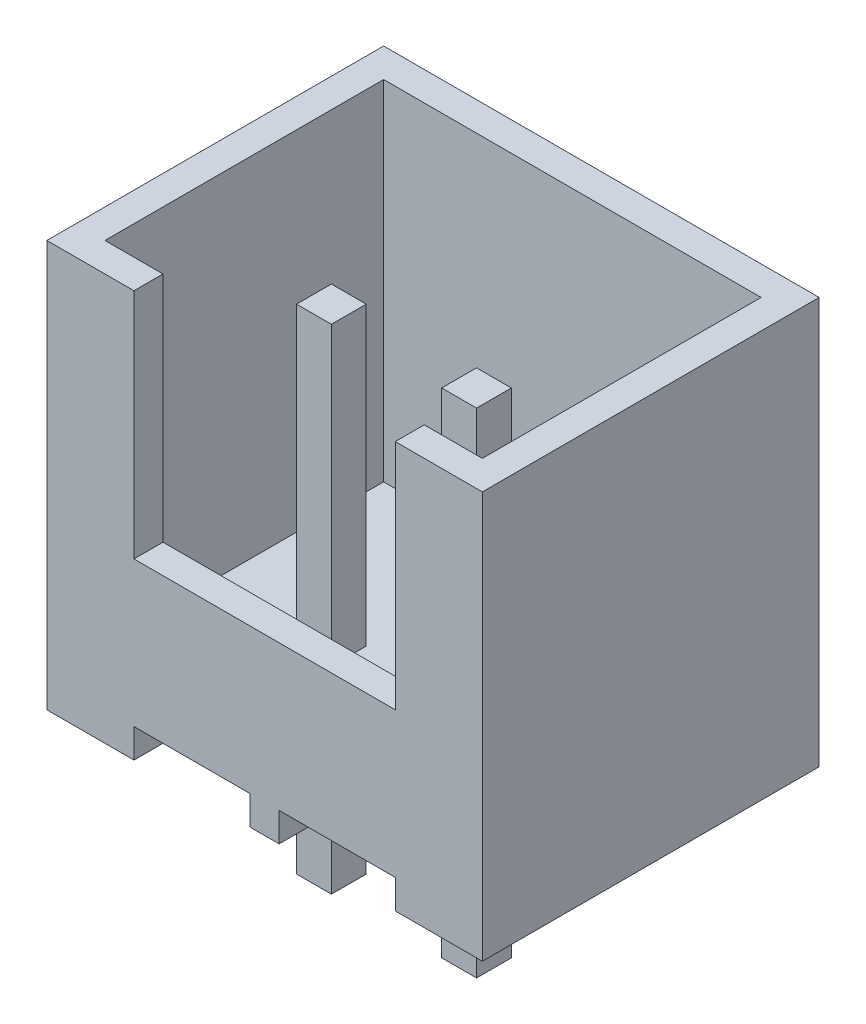
ISO-10303-21;
HEADER;
FILE_DESCRIPTION(('STEP AP214'),'2;1');
FILE_NAME('part.step','',(''),(''),'','','');
FILE_SCHEMA(('AUTOMOTIVE_DESIGN { 1 0 10303 214 1 1 1 1 }'));
ENDSEC;
DATA;
#1=APPLICATION_CONTEXT('core data for automotive mechanical design processes');
#2=APPLICATION_PROTOCOL_DEFINITION('international standard','automotive_design',2000,#1);
#3=PRODUCT_CONTEXT('',#1,'mechanical');
#4=PRODUCT('Part','Part','',(#3));
#5=PRODUCT_RELATED_PRODUCT_CATEGORY('part','',(#4));
#6=PRODUCT_DEFINITION_FORMATION('','',#4);
#7=PRODUCT_DEFINITION_CONTEXT('part definition',#1,'design');
#8=PRODUCT_DEFINITION('design','',#6,#7);
#9=PRODUCT_DEFINITION_SHAPE('','',#8);
#10=(LENGTH_UNIT() NAMED_UNIT(*) SI_UNIT(.MILLI.,.METRE.));
#11=(NAMED_UNIT(*) PLANE_ANGLE_UNIT() SI_UNIT($,.RADIAN.));
#12=(NAMED_UNIT(*) SI_UNIT($,.STERADIAN.) SOLID_ANGLE_UNIT());
#13=UNCERTAINTY_MEASURE_WITH_UNIT(LENGTH_MEASURE(1.E-05),#10,'distance_accuracy_value','');
#14=(GEOMETRIC_REPRESENTATION_CONTEXT(3) GLOBAL_UNCERTAINTY_ASSIGNED_CONTEXT((#13)) GLOBAL_UNIT_ASSIGNED_CONTEXT((#10,
#11,#12)) REPRESENTATION_CONTEXT('',''));
#15=CARTESIAN_POINT('',(0.,0.,0.));
#16=DIRECTION('',(0.,0.,1.));
#17=DIRECTION('',(1.,0.,0.));
#18=AXIS2_PLACEMENT_3D('',#15,#16,#17);
#19=CARTESIAN_POINT('',(0.,1.,0.));
#20=DIRECTION('',(0.,1.,0.));
#21=DIRECTION('',(0.,0.,1.));
#22=AXIS2_PLACEMENT_3D('',#19,#20,#21);
#23=PLANE('',#22);
#24=DIRECTION('',(0.,0.,1.));
#25=VECTOR('',#24,1.);
#26=CARTESIAN_POINT('',(0.5,1.,0.5));
#27=LINE('',#26,#25);
#28=CARTESIAN_POINT('',(0.5,1.,0.5));
#29=VERTEX_POINT('',#28);
#30=CARTESIAN_POINT('',(0.500000000000001,1.,5.3));
#31=VERTEX_POINT('',#30);
#32=EDGE_CURVE('E497',#29,#31,#27,.T.);
#33=ORIENTED_EDGE('',*,*,#32,.T.);
#34=DIRECTION('',(1.,0.,0.));
#35=VECTOR('',#34,1.);
#36=CARTESIAN_POINT('',(0.500000000000001,1.,5.3));
#37=LINE('',#36,#35);
#38=CARTESIAN_POINT('',(7.,1.,5.3));
#39=VERTEX_POINT('',#38);
#40=EDGE_CURVE('E500',#31,#39,#37,.T.);
#41=ORIENTED_EDGE('',*,*,#40,.T.);
#42=DIRECTION('',(0.,0.,-1.));
#43=VECTOR('',#42,1.);
#44=CARTESIAN_POINT('',(7.,1.,0.5));
#45=LINE('',#44,#43);
#46=CARTESIAN_POINT('',(7.,1.,0.5));
#47=VERTEX_POINT('',#46);
#48=EDGE_CURVE('E504',#39,#47,#45,.T.);
#49=ORIENTED_EDGE('',*,*,#48,.T.);
#50=DIRECTION('',(-1.,0.,0.));
#51=VECTOR('',#50,1.);
#52=CARTESIAN_POINT('',(0.5,1.,0.5));
#53=LINE('',#52,#51);
#54=EDGE_CURVE('E507',#47,#29,#53,.T.);
#55=ORIENTED_EDGE('',*,*,#54,.T.);
#56=EDGE_LOOP('',(#33,#41,#49,#55));
#57=FACE_BOUND('',#56,.T.);
#58=DIRECTION('',(-1.,0.,0.));
#59=VECTOR('',#58,1.);
#60=CARTESIAN_POINT('',(0.,1.,3.7));
#61=LINE('',#60,#59);
#62=CARTESIAN_POINT('',(2.8,1.,3.7));
#63=VERTEX_POINT('',#62);
#64=CARTESIAN_POINT('',(2.2,1.,3.7));
#65=VERTEX_POINT('',#64);
#66=EDGE_CURVE('E361',#63,#65,#61,.T.);
#67=ORIENTED_EDGE('',*,*,#66,.T.);
#68=DIRECTION('',(0.,0.,-1.));
#69=VECTOR('',#68,1.);
#70=CARTESIAN_POINT('',(2.2,1.,0.));
#71=LINE('',#70,#69);
#72=CARTESIAN_POINT('',(2.2,1.,3.1));
#73=VERTEX_POINT('',#72);
#74=EDGE_CURVE('E370',#65,#73,#71,.T.);
#75=ORIENTED_EDGE('',*,*,#74,.T.);
#76=DIRECTION('',(1.,0.,0.));
#77=VECTOR('',#76,1.);
#78=CARTESIAN_POINT('',(0.,1.,3.1));
#79=LINE('',#78,#77);
#80=CARTESIAN_POINT('',(2.8,1.,3.1));
#81=VERTEX_POINT('',#80);
#82=EDGE_CURVE('E367',#73,#81,#79,.T.);
#83=ORIENTED_EDGE('',*,*,#82,.T.);
#84=DIRECTION('',(0.,0.,1.));
#85=VECTOR('',#84,1.);
#86=CARTESIAN_POINT('',(2.8,1.,0.));
#87=LINE('',#86,#85);
#88=EDGE_CURVE('E364',#81,#63,#87,.T.);
#89=ORIENTED_EDGE('',*,*,#88,.T.);
#90=EDGE_LOOP('',(#67,#75,#83,#89));
#91=FACE_BOUND('',#90,.T.);
#92=DIRECTION('',(0.,0.,1.));
#93=VECTOR('',#92,1.);
#94=CARTESIAN_POINT('',(5.3,1.,0.));
#95=LINE('',#94,#93);
#96=CARTESIAN_POINT('',(5.3,1.,3.1));
#97=VERTEX_POINT('',#96);
#98=CARTESIAN_POINT('',(5.3,1.,3.7));
#99=VERTEX_POINT('',#98);
#100=EDGE_CURVE('E435',#97,#99,#95,.T.);
#101=ORIENTED_EDGE('',*,*,#100,.T.);
#102=DIRECTION('',(-1.,0.,0.));
#103=VECTOR('',#102,1.);
#104=CARTESIAN_POINT('',(0.,1.,3.7));
#105=LINE('',#104,#103);
#106=CARTESIAN_POINT('',(4.7,1.,3.7));
#107=VERTEX_POINT('',#106);
#108=EDGE_CURVE('E444',#99,#107,#105,.T.);
#109=ORIENTED_EDGE('',*,*,#108,.T.);
#110=DIRECTION('',(0.,0.,-1.));
#111=VECTOR('',#110,1.);
#112=CARTESIAN_POINT('',(4.7,1.,0.));
#113=LINE('',#112,#111);
#114=CARTESIAN_POINT('',(4.7,1.,3.1));
#115=VERTEX_POINT('',#114);
#116=EDGE_CURVE('E441',#107,#115,#113,.T.);
#117=ORIENTED_EDGE('',*,*,#116,.T.);
#118=DIRECTION('',(1.,0.,0.));
#119=VECTOR('',#118,1.);
#120=CARTESIAN_POINT('',(0.,1.,3.1));
#121=LINE('',#120,#119);
#122=EDGE_CURVE('E438',#115,#97,#121,.T.);
#123=ORIENTED_EDGE('',*,*,#122,.T.);
#124=EDGE_LOOP('',(#101,#109,#117,#123));
#125=FACE_BOUND('',#124,.T.);
#126=ADVANCED_FACE('F34',(#57,#91,#125),#23,.T.);
#127=CARTESIAN_POINT('',(4.,0.5,5.8));
#128=DIRECTION('',(0.,1.,0.));
#129=DIRECTION('',(0.,0.,1.));
#130=AXIS2_PLACEMENT_3D('',#127,#128,#129);
#131=PLANE('',#130);
#132=DIRECTION('',(1.,0.,0.));
#133=VECTOR('',#132,1.);
#134=CARTESIAN_POINT('',(4.,0.5,0.));
#135=LINE('',#134,#133);
#136=CARTESIAN_POINT('',(4.,0.5,0.));
#137=VERTEX_POINT('',#136);
#138=CARTESIAN_POINT('',(6.,0.5,0.));
#139=VERTEX_POINT('',#138);
#140=EDGE_CURVE('E316',#137,#139,#135,.T.);
#141=ORIENTED_EDGE('',*,*,#140,.T.);
#142=DIRECTION('',(0.,0.,-1.));
#143=VECTOR('',#142,1.);
#144=CARTESIAN_POINT('',(6.,0.5,5.8));
#145=LINE('',#144,#143);
#146=CARTESIAN_POINT('',(6.,0.5,5.8));
#147=VERTEX_POINT('',#146);
#148=EDGE_CURVE('E337',#147,#139,#145,.T.);
#149=ORIENTED_EDGE('',*,*,#148,.F.);
#150=DIRECTION('',(1.,0.,0.));
#151=VECTOR('',#150,1.);
#152=CARTESIAN_POINT('',(4.,0.5,5.8));
#153=LINE('',#152,#151);
#154=CARTESIAN_POINT('',(4.,0.5,5.8));
#155=VERTEX_POINT('',#154);
#156=EDGE_CURVE('E541',#155,#147,#153,.T.);
#157=ORIENTED_EDGE('',*,*,#156,.F.);
#158=DIRECTION('',(0.,0.,-1.));
#159=VECTOR('',#158,1.);
#160=CARTESIAN_POINT('',(4.,0.5,5.8));
#161=LINE('',#160,#159);
#162=EDGE_CURVE('E340',#155,#137,#161,.T.);
#163=ORIENTED_EDGE('',*,*,#162,.T.);
#164=EDGE_LOOP('',(#141,#149,#157,#163));
#165=FACE_BOUND('',#164,.T.);
#166=DIRECTION('',(-1.,0.,0.));
#167=VECTOR('',#166,1.);
#168=CARTESIAN_POINT('',(4.,0.5,3.7));
#169=LINE('',#168,#167);
#170=CARTESIAN_POINT('',(5.3,0.5,3.7));
#171=VERTEX_POINT('',#170);
#172=CARTESIAN_POINT('',(4.7,0.5,3.7));
#173=VERTEX_POINT('',#172);
#174=EDGE_CURVE('E382',#171,#173,#169,.T.);
#175=ORIENTED_EDGE('',*,*,#174,.F.);
#176=DIRECTION('',(0.,0.,1.));
#177=VECTOR('',#176,1.);
#178=CARTESIAN_POINT('',(5.3,0.5,5.8));
#179=LINE('',#178,#177);
#180=CARTESIAN_POINT('',(5.3,0.5,3.1));
#181=VERTEX_POINT('',#180);
#182=EDGE_CURVE('E373',#181,#171,#179,.T.);
#183=ORIENTED_EDGE('',*,*,#182,.F.);
#184=DIRECTION('',(1.,0.,0.));
#185=VECTOR('',#184,1.);
#186=CARTESIAN_POINT('',(4.,0.5,3.1));
#187=LINE('',#186,#185);
#188=CARTESIAN_POINT('',(4.7,0.5,3.1));
#189=VERTEX_POINT('',#188);
#190=EDGE_CURVE('E376',#189,#181,#187,.T.);
#191=ORIENTED_EDGE('',*,*,#190,.F.);
#192=DIRECTION('',(0.,0.,-1.));
#193=VECTOR('',#192,1.);
#194=CARTESIAN_POINT('',(4.7,0.5,5.8));
#195=LINE('',#194,#193);
#196=EDGE_CURVE('E379',#173,#189,#195,.T.);
#197=ORIENTED_EDGE('',*,*,#196,.F.);
#198=EDGE_LOOP('',(#175,#183,#191,#197));
#199=FACE_BOUND('',#198,.T.);
#200=ADVANCED_FACE('F572',(#165,#199),#131,.F.);
#201=CARTESIAN_POINT('',(1.5,0.5,5.8));
#202=DIRECTION('',(0.,1.,0.));
#203=DIRECTION('',(0.,0.,1.));
#204=AXIS2_PLACEMENT_3D('',#201,#202,#203);
#205=PLANE('',#204);
#206=DIRECTION('',(1.,0.,0.));
#207=VECTOR('',#206,1.);
#208=CARTESIAN_POINT('',(1.5,0.5,0.));
#209=LINE('',#208,#207);
#210=CARTESIAN_POINT('',(1.5,0.5,0.));
#211=VERTEX_POINT('',#210);
#212=CARTESIAN_POINT('',(3.5,0.5,0.));
#213=VERTEX_POINT('',#212);
#214=EDGE_CURVE('E308',#211,#213,#209,.T.);
#215=ORIENTED_EDGE('',*,*,#214,.T.);
#216=DIRECTION('',(0.,0.,-1.));
#217=VECTOR('',#216,1.);
#218=CARTESIAN_POINT('',(3.5,0.5,5.8));
#219=LINE('',#218,#217);
#220=CARTESIAN_POINT('',(3.5,0.5,5.8));
#221=VERTEX_POINT('',#220);
#222=EDGE_CURVE('E349',#221,#213,#219,.T.);
#223=ORIENTED_EDGE('',*,*,#222,.F.);
#224=DIRECTION('',(1.,0.,0.));
#225=VECTOR('',#224,1.);
#226=CARTESIAN_POINT('',(1.5,0.5,5.8));
#227=LINE('',#226,#225);
#228=CARTESIAN_POINT('',(1.5,0.5,5.8));
#229=VERTEX_POINT('',#228);
#230=EDGE_CURVE('E533',#229,#221,#227,.T.);
#231=ORIENTED_EDGE('',*,*,#230,.F.);
#232=DIRECTION('',(0.,0.,-1.));
#233=VECTOR('',#232,1.);
#234=CARTESIAN_POINT('',(1.5,0.5,5.8));
#235=LINE('',#234,#233);
#236=EDGE_CURVE('E352',#229,#211,#235,.T.);
#237=ORIENTED_EDGE('',*,*,#236,.T.);
#238=EDGE_LOOP('',(#215,#223,#231,#237));
#239=FACE_BOUND('',#238,.T.);
#240=DIRECTION('',(0.,0.,-1.));
#241=VECTOR('',#240,1.);
#242=CARTESIAN_POINT('',(2.2,0.5,5.8));
#243=LINE('',#242,#241);
#244=CARTESIAN_POINT('',(2.2,0.5,3.7));
#245=VERTEX_POINT('',#244);
#246=CARTESIAN_POINT('',(2.2,0.5,3.1));
#247=VERTEX_POINT('',#246);
#248=EDGE_CURVE('E493',#245,#247,#243,.T.);
#249=ORIENTED_EDGE('',*,*,#248,.F.);
#250=DIRECTION('',(-1.,0.,0.));
#251=VECTOR('',#250,1.);
#252=CARTESIAN_POINT('',(1.5,0.5,3.7));
#253=LINE('',#252,#251);
#254=CARTESIAN_POINT('',(2.8,0.5,3.7));
#255=VERTEX_POINT('',#254);
#256=EDGE_CURVE('E484',#255,#245,#253,.T.);
#257=ORIENTED_EDGE('',*,*,#256,.F.);
#258=DIRECTION('',(0.,0.,1.));
#259=VECTOR('',#258,1.);
#260=CARTESIAN_POINT('',(2.8,0.5,5.8));
#261=LINE('',#260,#259);
#262=CARTESIAN_POINT('',(2.8,0.5,3.1));
#263=VERTEX_POINT('',#262);
#264=EDGE_CURVE('E487',#263,#255,#261,.T.);
#265=ORIENTED_EDGE('',*,*,#264,.F.);
#266=DIRECTION('',(1.,0.,0.));
#267=VECTOR('',#266,1.);
#268=CARTESIAN_POINT('',(1.5,0.5,3.1));
#269=LINE('',#268,#267);
#270=EDGE_CURVE('E490',#247,#263,#269,.T.);
#271=ORIENTED_EDGE('',*,*,#270,.F.);
#272=EDGE_LOOP('',(#249,#257,#265,#271));
#273=FACE_BOUND('',#272,.T.);
#274=ADVANCED_FACE('F578',(#239,#273),#205,.F.);
#275=CARTESIAN_POINT('',(0.,0.,5.8));
#276=DIRECTION('',(1.,0.,0.));
#277=DIRECTION('',(0.,0.,-1.));
#278=AXIS2_PLACEMENT_3D('',#275,#276,#277);
#279=PLANE('',#278);
#280=DIRECTION('',(0.,-1.,0.));
#281=VECTOR('',#280,1.);
#282=CARTESIAN_POINT('',(0.,0.,0.));
#283=LINE('',#282,#281);
#284=CARTESIAN_POINT('',(0.,7.,0.));
#285=VERTEX_POINT('',#284);
#286=CARTESIAN_POINT('',(0.,0.,0.));
#287=VERTEX_POINT('',#286);
#288=EDGE_CURVE('E300',#285,#287,#283,.T.);
#289=ORIENTED_EDGE('',*,*,#288,.T.);
#290=DIRECTION('',(0.,0.,-1.));
#291=VECTOR('',#290,1.);
#292=CARTESIAN_POINT('',(0.,0.,5.8));
#293=LINE('',#292,#291);
#294=CARTESIAN_POINT('',(0.,0.,5.8));
#295=VERTEX_POINT('',#294);
#296=EDGE_CURVE('E358',#295,#287,#293,.T.);
#297=ORIENTED_EDGE('',*,*,#296,.F.);
#298=DIRECTION('',(0.,-1.,0.));
#299=VECTOR('',#298,1.);
#300=CARTESIAN_POINT('',(0.,0.,5.8));
#301=LINE('',#300,#299);
#302=CARTESIAN_POINT('',(0.,7.,5.8));
#303=VERTEX_POINT('',#302);
#304=EDGE_CURVE('E326',#303,#295,#301,.T.);
#305=ORIENTED_EDGE('',*,*,#304,.F.);
#306=DIRECTION('',(0.,0.,-1.));
#307=VECTOR('',#306,1.);
#308=CARTESIAN_POINT('',(0.,7.,5.8));
#309=LINE('',#308,#307);
#310=EDGE_CURVE('E291',#303,#285,#309,.T.);
#311=ORIENTED_EDGE('',*,*,#310,.T.);
#312=EDGE_LOOP('',(#289,#297,#305,#311));
#313=FACE_BOUND('',#312,.T.);
#314=ADVANCED_FACE('F36',(#313),#279,.F.);
#315=CARTESIAN_POINT('',(0.,0.,5.8));
#316=DIRECTION('',(0.,1.,0.));
#317=DIRECTION('',(0.,0.,1.));
#318=AXIS2_PLACEMENT_3D('',#315,#316,#317);
#319=PLANE('',#318);
#320=DIRECTION('',(1.,0.,0.));
#321=VECTOR('',#320,1.);
#322=CARTESIAN_POINT('',(0.,0.,0.));
#323=LINE('',#322,#321);
#324=CARTESIAN_POINT('',(1.5,0.,0.));
#325=VERTEX_POINT('',#324);
#326=EDGE_CURVE('E303',#287,#325,#323,.T.);
#327=ORIENTED_EDGE('',*,*,#326,.T.);
#328=DIRECTION('',(0.,0.,-1.));
#329=VECTOR('',#328,1.);
#330=CARTESIAN_POINT('',(1.5,0.,5.8));
#331=LINE('',#330,#329);
#332=CARTESIAN_POINT('',(1.5,0.,5.8));
#333=VERTEX_POINT('',#332);
#334=EDGE_CURVE('E355',#333,#325,#331,.T.);
#335=ORIENTED_EDGE('',*,*,#334,.F.);
#336=DIRECTION('',(1.,0.,0.));
#337=VECTOR('',#336,1.);
#338=CARTESIAN_POINT('',(0.,0.,5.8));
#339=LINE('',#338,#337);
#340=EDGE_CURVE('E529',#295,#333,#339,.T.);
#341=ORIENTED_EDGE('',*,*,#340,.F.);
#342=ORIENTED_EDGE('',*,*,#296,.T.);
#343=EDGE_LOOP('',(#327,#335,#341,#342));
#344=FACE_BOUND('',#343,.T.);
#345=ADVANCED_FACE('F634',(#344),#319,.F.);
#346=CARTESIAN_POINT('',(1.5,0.,5.8));
#347=DIRECTION('',(-1.,0.,0.));
#348=DIRECTION('',(0.,0.,1.));
#349=AXIS2_PLACEMENT_3D('',#346,#347,#348);
#350=PLANE('',#349);
#351=DIRECTION('',(0.,1.,0.));
#352=VECTOR('',#351,1.);
#353=CARTESIAN_POINT('',(1.5,0.,0.));
#354=LINE('',#353,#352);
#355=EDGE_CURVE('E306',#325,#211,#354,.T.);
#356=ORIENTED_EDGE('',*,*,#355,.T.);
#357=ORIENTED_EDGE('',*,*,#236,.F.);
#358=DIRECTION('',(0.,1.,0.));
#359=VECTOR('',#358,1.);
#360=CARTESIAN_POINT('',(1.5,0.,5.8));
#361=LINE('',#360,#359);
#362=EDGE_CURVE('E531',#333,#229,#361,.T.);
#363=ORIENTED_EDGE('',*,*,#362,.F.);
#364=ORIENTED_EDGE('',*,*,#334,.T.);
#365=EDGE_LOOP('',(#356,#357,#363,#364));
#366=FACE_BOUND('',#365,.T.);
#367=ADVANCED_FACE('F628',(#366),#350,.F.);
#368=CARTESIAN_POINT('',(3.5,0.5,5.8));
#369=DIRECTION('',(1.,0.,0.));
#370=DIRECTION('',(0.,0.,-1.));
#371=AXIS2_PLACEMENT_3D('',#368,#369,#370);
#372=PLANE('',#371);
#373=DIRECTION('',(0.,-1.,0.));
#374=VECTOR('',#373,1.);
#375=CARTESIAN_POINT('',(3.5,0.5,0.));
#376=LINE('',#375,#374);
#377=CARTESIAN_POINT('',(3.5,0.,0.));
#378=VERTEX_POINT('',#377);
#379=EDGE_CURVE('E310',#213,#378,#376,.T.);
#380=ORIENTED_EDGE('',*,*,#379,.T.);
#381=DIRECTION('',(0.,0.,-1.));
#382=VECTOR('',#381,1.);
#383=CARTESIAN_POINT('',(3.5,0.,5.8));
#384=LINE('',#383,#382);
#385=CARTESIAN_POINT('',(3.5,0.,5.8));
#386=VERTEX_POINT('',#385);
#387=EDGE_CURVE('E346',#386,#378,#384,.T.);
#388=ORIENTED_EDGE('',*,*,#387,.F.);
#389=DIRECTION('',(0.,-1.,0.));
#390=VECTOR('',#389,1.);
#391=CARTESIAN_POINT('',(3.5,0.5,5.8));
#392=LINE('',#391,#390);
#393=EDGE_CURVE('E535',#221,#386,#392,.T.);
#394=ORIENTED_EDGE('',*,*,#393,.F.);
#395=ORIENTED_EDGE('',*,*,#222,.T.);
#396=EDGE_LOOP('',(#380,#388,#394,#395));
#397=FACE_BOUND('',#396,.T.);
#398=ADVANCED_FACE('F624',(#397),#372,.F.);
#399=CARTESIAN_POINT('',(3.5,0.,5.8));
#400=DIRECTION('',(0.,1.,0.));
#401=DIRECTION('',(0.,0.,1.));
#402=AXIS2_PLACEMENT_3D('',#399,#400,#401);
#403=PLANE('',#402);
#404=DIRECTION('',(1.,0.,0.));
#405=VECTOR('',#404,1.);
#406=CARTESIAN_POINT('',(3.5,0.,0.));
#407=LINE('',#406,#405);
#408=CARTESIAN_POINT('',(4.,0.,0.));
#409=VERTEX_POINT('',#408);
#410=EDGE_CURVE('E312',#378,#409,#407,.T.);
#411=ORIENTED_EDGE('',*,*,#410,.T.);
#412=DIRECTION('',(0.,0.,-1.));
#413=VECTOR('',#412,1.);
#414=CARTESIAN_POINT('',(4.,0.,5.8));
#415=LINE('',#414,#413);
#416=CARTESIAN_POINT('',(4.,0.,5.8));
#417=VERTEX_POINT('',#416);
#418=EDGE_CURVE('E343',#417,#409,#415,.T.);
#419=ORIENTED_EDGE('',*,*,#418,.F.);
#420=DIRECTION('',(1.,0.,0.));
#421=VECTOR('',#420,1.);
#422=CARTESIAN_POINT('',(3.5,0.,5.8));
#423=LINE('',#422,#421);
#424=EDGE_CURVE('E537',#386,#417,#423,.T.);
#425=ORIENTED_EDGE('',*,*,#424,.F.);
#426=ORIENTED_EDGE('',*,*,#387,.T.);
#427=EDGE_LOOP('',(#411,#419,#425,#426));
#428=FACE_BOUND('',#427,.T.);
#429=ADVANCED_FACE('F620',(#428),#403,.F.);
#430=CARTESIAN_POINT('',(4.,0.,5.8));
#431=DIRECTION('',(-1.,0.,0.));
#432=DIRECTION('',(0.,0.,1.));
#433=AXIS2_PLACEMENT_3D('',#430,#431,#432);
#434=PLANE('',#433);
#435=DIRECTION('',(0.,1.,0.));
#436=VECTOR('',#435,1.);
#437=CARTESIAN_POINT('',(4.,0.,0.));
#438=LINE('',#437,#436);
#439=EDGE_CURVE('E314',#409,#137,#438,.T.);
#440=ORIENTED_EDGE('',*,*,#439,.T.);
#441=ORIENTED_EDGE('',*,*,#162,.F.);
#442=DIRECTION('',(0.,1.,0.));
#443=VECTOR('',#442,1.);
#444=CARTESIAN_POINT('',(4.,0.,5.8));
#445=LINE('',#444,#443);
#446=EDGE_CURVE('E539',#417,#155,#445,.T.);
#447=ORIENTED_EDGE('',*,*,#446,.F.);
#448=ORIENTED_EDGE('',*,*,#418,.T.);
#449=EDGE_LOOP('',(#440,#441,#447,#448));
#450=FACE_BOUND('',#449,.T.);
#451=ADVANCED_FACE('F615',(#450),#434,.F.);
#452=CARTESIAN_POINT('',(6.,0.5,5.8));
#453=DIRECTION('',(1.,0.,0.));
#454=DIRECTION('',(0.,0.,-1.));
#455=AXIS2_PLACEMENT_3D('',#452,#453,#454);
#456=PLANE('',#455);
#457=DIRECTION('',(0.,-1.,0.));
#458=VECTOR('',#457,1.);
#459=CARTESIAN_POINT('',(6.,0.5,0.));
#460=LINE('',#459,#458);
#461=CARTESIAN_POINT('',(6.,0.,0.));
#462=VERTEX_POINT('',#461);
#463=EDGE_CURVE('E318',#139,#462,#460,.T.);
#464=ORIENTED_EDGE('',*,*,#463,.T.);
#465=DIRECTION('',(0.,0.,-1.));
#466=VECTOR('',#465,1.);
#467=CARTESIAN_POINT('',(6.,0.,5.8));
#468=LINE('',#467,#466);
#469=CARTESIAN_POINT('',(6.,0.,5.8));
#470=VERTEX_POINT('',#469);
#471=EDGE_CURVE('E334',#470,#462,#468,.T.);
#472=ORIENTED_EDGE('',*,*,#471,.F.);
#473=DIRECTION('',(0.,-1.,0.));
#474=VECTOR('',#473,1.);
#475=CARTESIAN_POINT('',(6.,0.5,5.8));
#476=LINE('',#475,#474);
#477=EDGE_CURVE('E543',#147,#470,#476,.T.);
#478=ORIENTED_EDGE('',*,*,#477,.F.);
#479=ORIENTED_EDGE('',*,*,#148,.T.);
#480=EDGE_LOOP('',(#464,#472,#478,#479));
#481=FACE_BOUND('',#480,.T.);
#482=ADVANCED_FACE('F613',(#481),#456,.F.);
#483=CARTESIAN_POINT('',(6.,0.,5.8));
#484=DIRECTION('',(0.,1.,0.));
#485=DIRECTION('',(0.,0.,1.));
#486=AXIS2_PLACEMENT_3D('',#483,#484,#485);
#487=PLANE('',#486);
#488=DIRECTION('',(1.,0.,0.));
#489=VECTOR('',#488,1.);
#490=CARTESIAN_POINT('',(6.,0.,0.));
#491=LINE('',#490,#489);
#492=CARTESIAN_POINT('',(7.5,0.,0.));
#493=VERTEX_POINT('',#492);
#494=EDGE_CURVE('E320',#462,#493,#491,.T.);
#495=ORIENTED_EDGE('',*,*,#494,.T.);
#496=DIRECTION('',(0.,0.,-1.));
#497=VECTOR('',#496,1.);
#498=CARTESIAN_POINT('',(7.5,0.,5.8));
#499=LINE('',#498,#497);
#500=CARTESIAN_POINT('',(7.5,0.,5.8));
#501=VERTEX_POINT('',#500);
#502=EDGE_CURVE('E331',#501,#493,#499,.T.);
#503=ORIENTED_EDGE('',*,*,#502,.F.);
#504=DIRECTION('',(1.,0.,0.));
#505=VECTOR('',#504,1.);
#506=CARTESIAN_POINT('',(6.,0.,5.8));
#507=LINE('',#506,#505);
#508=EDGE_CURVE('E296',#470,#501,#507,.T.);
#509=ORIENTED_EDGE('',*,*,#508,.F.);
#510=ORIENTED_EDGE('',*,*,#471,.T.);
#511=EDGE_LOOP('',(#495,#503,#509,#510));
#512=FACE_BOUND('',#511,.T.);
#513=ADVANCED_FACE('F551',(#512),#487,.F.);
#514=CARTESIAN_POINT('',(7.5,0.,5.8));
#515=DIRECTION('',(-1.,0.,0.));
#516=DIRECTION('',(0.,0.,1.));
#517=AXIS2_PLACEMENT_3D('',#514,#515,#516);
#518=PLANE('',#517);
#519=DIRECTION('',(0.,1.,0.));
#520=VECTOR('',#519,1.);
#521=CARTESIAN_POINT('',(7.5,0.,0.));
#522=LINE('',#521,#520);
#523=CARTESIAN_POINT('',(7.5,7.,0.));
#524=VERTEX_POINT('',#523);
#525=EDGE_CURVE('E322',#493,#524,#522,.T.);
#526=ORIENTED_EDGE('',*,*,#525,.T.);
#527=DIRECTION('',(0.,0.,-1.));
#528=VECTOR('',#527,1.);
#529=CARTESIAN_POINT('',(7.5,7.,5.8));
#530=LINE('',#529,#528);
#531=CARTESIAN_POINT('',(7.5,7.,5.8));
#532=VERTEX_POINT('',#531);
#533=EDGE_CURVE('E328',#532,#524,#530,.T.);
#534=ORIENTED_EDGE('',*,*,#533,.F.);
#535=DIRECTION('',(0.,1.,0.));
#536=VECTOR('',#535,1.);
#537=CARTESIAN_POINT('',(7.5,0.,5.8));
#538=LINE('',#537,#536);
#539=EDGE_CURVE('E294',#501,#532,#538,.T.);
#540=ORIENTED_EDGE('',*,*,#539,.F.);
#541=ORIENTED_EDGE('',*,*,#502,.T.);
#542=EDGE_LOOP('',(#526,#534,#540,#541));
#543=FACE_BOUND('',#542,.T.);
#544=ADVANCED_FACE('F555',(#543),#518,.F.);
#545=CARTESIAN_POINT('',(0.,7.,5.8));
#546=DIRECTION('',(0.,-1.,0.));
#547=DIRECTION('',(0.,0.,-1.));
#548=AXIS2_PLACEMENT_3D('',#545,#546,#547);
#549=PLANE('',#548);
#550=DIRECTION('',(1.,0.,0.));
#551=VECTOR('',#550,1.);
#552=CARTESIAN_POINT('',(0.500000000000001,7.,5.3));
#553=LINE('',#552,#551);
#554=CARTESIAN_POINT('',(6.,7.,5.3));
#555=VERTEX_POINT('',#554);
#556=CARTESIAN_POINT('',(7.,7.,5.3));
#557=VERTEX_POINT('',#556);
#558=EDGE_CURVE('E512',#555,#557,#553,.T.);
#559=ORIENTED_EDGE('',*,*,#558,.F.);
#560=DIRECTION('',(0.,0.,1.));
#561=VECTOR('',#560,1.);
#562=CARTESIAN_POINT('',(6.,7.,4.8));
#563=LINE('',#562,#561);
#564=CARTESIAN_POINT('',(6.,7.,5.8));
#565=VERTEX_POINT('',#564);
#566=EDGE_CURVE('E393',#555,#565,#563,.T.);
#567=ORIENTED_EDGE('',*,*,#566,.T.);
#568=DIRECTION('',(-1.,0.,0.));
#569=VECTOR('',#568,1.);
#570=CARTESIAN_POINT('',(0.,7.,5.8));
#571=LINE('',#570,#569);
#572=EDGE_CURVE('E293',#532,#565,#571,.T.);
#573=ORIENTED_EDGE('',*,*,#572,.F.);
#574=ORIENTED_EDGE('',*,*,#533,.T.);
#575=DIRECTION('',(-1.,0.,0.));
#576=VECTOR('',#575,1.);
#577=CARTESIAN_POINT('',(0.,7.,0.));
#578=LINE('',#577,#576);
#579=EDGE_CURVE('E324',#524,#285,#578,.T.);
#580=ORIENTED_EDGE('',*,*,#579,.T.);
#581=ORIENTED_EDGE('',*,*,#310,.F.);
#582=CARTESIAN_POINT('',(1.5,7.,5.8));
#583=VERTEX_POINT('',#582);
#584=EDGE_CURVE('E282',#583,#303,#571,.T.);
#585=ORIENTED_EDGE('',*,*,#584,.F.);
#586=DIRECTION('',(0.,0.,1.));
#587=VECTOR('',#586,1.);
#588=CARTESIAN_POINT('',(1.5,7.,4.8));
#589=LINE('',#588,#587);
#590=CARTESIAN_POINT('',(1.5,7.,5.3));
#591=VERTEX_POINT('',#590);
#592=EDGE_CURVE('E265',#591,#583,#589,.T.);
#593=ORIENTED_EDGE('',*,*,#592,.F.);
#594=CARTESIAN_POINT('',(0.500000000000001,7.,5.3));
#595=VERTEX_POINT('',#594);
#596=EDGE_CURVE('E513',#595,#591,#553,.T.);
#597=ORIENTED_EDGE('',*,*,#596,.F.);
#598=DIRECTION('',(0.,0.,1.));
#599=VECTOR('',#598,1.);
#600=CARTESIAN_POINT('',(0.5,7.,0.5));
#601=LINE('',#600,#599);
#602=CARTESIAN_POINT('',(0.5,7.,0.5));
#603=VERTEX_POINT('',#602);
#604=EDGE_CURVE('E496',#603,#595,#601,.T.);
#605=ORIENTED_EDGE('',*,*,#604,.F.);
#606=DIRECTION('',(-1.,0.,0.));
#607=VECTOR('',#606,1.);
#608=CARTESIAN_POINT('',(0.5,7.,0.5));
#609=LINE('',#608,#607);
#610=CARTESIAN_POINT('',(7.,7.,0.5));
#611=VERTEX_POINT('',#610);
#612=EDGE_CURVE('E501',#611,#603,#609,.T.);
#613=ORIENTED_EDGE('',*,*,#612,.F.);
#614=DIRECTION('',(0.,0.,-1.));
#615=VECTOR('',#614,1.);
#616=CARTESIAN_POINT('',(7.,7.,0.5));
#617=LINE('',#616,#615);
#618=EDGE_CURVE('E515',#557,#611,#617,.T.);
#619=ORIENTED_EDGE('',*,*,#618,.F.);
#620=EDGE_LOOP('',(#559,#567,#573,#574,#580,#581,#585,#593,#597,#605,#613,#619));
#621=FACE_BOUND('',#620,.T.);
#622=ADVANCED_FACE('F289',(#621),#549,.F.);
#623=CARTESIAN_POINT('',(0.,0.,5.8));
#624=DIRECTION('',(0.,0.,-1.));
#625=DIRECTION('',(-1.,0.,0.));
#626=AXIS2_PLACEMENT_3D('',#623,#624,#625);
#627=PLANE('',#626);
#628=ORIENTED_EDGE('',*,*,#572,.T.);
#629=DIRECTION('',(0.,1.,0.));
#630=VECTOR('',#629,1.);
#631=CARTESIAN_POINT('',(6.,3.,5.8));
#632=LINE('',#631,#630);
#633=CARTESIAN_POINT('',(6.,3.,5.8));
#634=VERTEX_POINT('',#633);
#635=EDGE_CURVE('E276',#634,#565,#632,.T.);
#636=ORIENTED_EDGE('',*,*,#635,.F.);
#637=DIRECTION('',(1.,0.,0.));
#638=VECTOR('',#637,1.);
#639=CARTESIAN_POINT('',(1.5,3.,5.8));
#640=LINE('',#639,#638);
#641=CARTESIAN_POINT('',(1.5,3.,5.8));
#642=VERTEX_POINT('',#641);
#643=EDGE_CURVE('E286',#642,#634,#640,.T.);
#644=ORIENTED_EDGE('',*,*,#643,.F.);
#645=DIRECTION('',(0.,-1.,0.));
#646=VECTOR('',#645,1.);
#647=CARTESIAN_POINT('',(1.5,7.,5.8));
#648=LINE('',#647,#646);
#649=EDGE_CURVE('E268',#583,#642,#648,.T.);
#650=ORIENTED_EDGE('',*,*,#649,.F.);
#651=ORIENTED_EDGE('',*,*,#584,.T.);
#652=ORIENTED_EDGE('',*,*,#304,.T.);
#653=ORIENTED_EDGE('',*,*,#340,.T.);
#654=ORIENTED_EDGE('',*,*,#362,.T.);
#655=ORIENTED_EDGE('',*,*,#230,.T.);
#656=ORIENTED_EDGE('',*,*,#393,.T.);
#657=ORIENTED_EDGE('',*,*,#424,.T.);
#658=ORIENTED_EDGE('',*,*,#446,.T.);
#659=ORIENTED_EDGE('',*,*,#156,.T.);
#660=ORIENTED_EDGE('',*,*,#477,.T.);
#661=ORIENTED_EDGE('',*,*,#508,.T.);
#662=ORIENTED_EDGE('',*,*,#539,.T.);
#663=EDGE_LOOP('',(#628,#636,#644,#650,#651,#652,#653,#654,#655,#656,#657,#658,#659,#660,#661,#662));
#664=FACE_BOUND('',#663,.T.);
#665=ADVANCED_FACE('F280',(#664),#627,.F.);
#666=CARTESIAN_POINT('',(0.,0.,0.));
#667=DIRECTION('',(0.,0.,-1.));
#668=DIRECTION('',(-1.,0.,0.));
#669=AXIS2_PLACEMENT_3D('',#666,#667,#668);
#670=PLANE('',#669);
#671=ORIENTED_EDGE('',*,*,#288,.F.);
#672=ORIENTED_EDGE('',*,*,#579,.F.);
#673=ORIENTED_EDGE('',*,*,#525,.F.);
#674=ORIENTED_EDGE('',*,*,#494,.F.);
#675=ORIENTED_EDGE('',*,*,#463,.F.);
#676=ORIENTED_EDGE('',*,*,#140,.F.);
#677=ORIENTED_EDGE('',*,*,#439,.F.);
#678=ORIENTED_EDGE('',*,*,#410,.F.);
#679=ORIENTED_EDGE('',*,*,#379,.F.);
#680=ORIENTED_EDGE('',*,*,#214,.F.);
#681=ORIENTED_EDGE('',*,*,#355,.F.);
#682=ORIENTED_EDGE('',*,*,#326,.F.);
#683=EDGE_LOOP('',(#671,#672,#673,#674,#675,#676,#677,#678,#679,#680,#681,#682));
#684=FACE_BOUND('',#683,.T.);
#685=ADVANCED_FACE('F600',(#684),#670,.T.);
#686=CARTESIAN_POINT('',(0.5,1.,0.5));
#687=DIRECTION('',(-1.,0.,0.));
#688=DIRECTION('',(0.,0.,1.));
#689=AXIS2_PLACEMENT_3D('',#686,#687,#688);
#690=PLANE('',#689);
#691=ORIENTED_EDGE('',*,*,#604,.T.);
#692=DIRECTION('',(0.,1.,0.));
#693=VECTOR('',#692,1.);
#694=CARTESIAN_POINT('',(0.500000000000001,1.,5.3));
#695=LINE('',#694,#693);
#696=EDGE_CURVE('E510',#31,#595,#695,.T.);
#697=ORIENTED_EDGE('',*,*,#696,.F.);
#698=ORIENTED_EDGE('',*,*,#32,.F.);
#699=DIRECTION('',(0.,1.,0.));
#700=VECTOR('',#699,1.);
#701=CARTESIAN_POINT('',(0.5,1.,0.5));
#702=LINE('',#701,#700);
#703=EDGE_CURVE('E304',#29,#603,#702,.T.);
#704=ORIENTED_EDGE('',*,*,#703,.T.);
#705=EDGE_LOOP('',(#691,#697,#698,#704));
#706=FACE_BOUND('',#705,.T.);
#707=ADVANCED_FACE('F590',(#706),#690,.F.);
#708=CARTESIAN_POINT('',(0.5,1.,0.5));
#709=DIRECTION('',(0.,0.,-1.));
#710=DIRECTION('',(-1.,0.,0.));
#711=AXIS2_PLACEMENT_3D('',#708,#709,#710);
#712=PLANE('',#711);
#713=ORIENTED_EDGE('',*,*,#612,.T.);
#714=ORIENTED_EDGE('',*,*,#703,.F.);
#715=ORIENTED_EDGE('',*,*,#54,.F.);
#716=DIRECTION('',(0.,1.,0.));
#717=VECTOR('',#716,1.);
#718=CARTESIAN_POINT('',(7.,1.,0.5));
#719=LINE('',#718,#717);
#720=EDGE_CURVE('E521',#47,#611,#719,.T.);
#721=ORIENTED_EDGE('',*,*,#720,.T.);
#722=EDGE_LOOP('',(#713,#714,#715,#721));
#723=FACE_BOUND('',#722,.T.);
#724=ADVANCED_FACE('F586',(#723),#712,.F.);
#725=CARTESIAN_POINT('',(7.,1.,0.5));
#726=DIRECTION('',(1.,0.,0.));
#727=DIRECTION('',(0.,0.,-1.));
#728=AXIS2_PLACEMENT_3D('',#725,#726,#727);
#729=PLANE('',#728);
#730=ORIENTED_EDGE('',*,*,#618,.T.);
#731=ORIENTED_EDGE('',*,*,#720,.F.);
#732=ORIENTED_EDGE('',*,*,#48,.F.);
#733=DIRECTION('',(0.,1.,0.));
#734=VECTOR('',#733,1.);
#735=CARTESIAN_POINT('',(7.,1.,5.3));
#736=LINE('',#735,#734);
#737=EDGE_CURVE('E523',#39,#557,#736,.T.);
#738=ORIENTED_EDGE('',*,*,#737,.T.);
#739=EDGE_LOOP('',(#730,#731,#732,#738));
#740=FACE_BOUND('',#739,.T.);
#741=ADVANCED_FACE('F589',(#740),#729,.F.);
#742=CARTESIAN_POINT('',(0.500000000000001,1.,5.3));
#743=DIRECTION('',(0.,0.,1.));
#744=DIRECTION('',(1.,0.,0.));
#745=AXIS2_PLACEMENT_3D('',#742,#743,#744);
#746=PLANE('',#745);
#747=DIRECTION('',(1.,0.,0.));
#748=VECTOR('',#747,1.);
#749=CARTESIAN_POINT('',(0.500000000000001,3.,5.3));
#750=LINE('',#749,#748);
#751=CARTESIAN_POINT('',(1.5,3.,5.3));
#752=VERTEX_POINT('',#751);
#753=CARTESIAN_POINT('',(6.,3.,5.3));
#754=VERTEX_POINT('',#753);
#755=EDGE_CURVE('E42',#752,#754,#750,.T.);
#756=ORIENTED_EDGE('',*,*,#755,.T.);
#757=DIRECTION('',(0.,1.,0.));
#758=VECTOR('',#757,1.);
#759=CARTESIAN_POINT('',(6.,1.,5.3));
#760=LINE('',#759,#758);
#761=EDGE_CURVE('E11',#754,#555,#760,.T.);
#762=ORIENTED_EDGE('',*,*,#761,.T.);
#763=ORIENTED_EDGE('',*,*,#558,.T.);
#764=ORIENTED_EDGE('',*,*,#737,.F.);
#765=ORIENTED_EDGE('',*,*,#40,.F.);
#766=ORIENTED_EDGE('',*,*,#696,.T.);
#767=ORIENTED_EDGE('',*,*,#596,.T.);
#768=DIRECTION('',(0.,-1.,0.));
#769=VECTOR('',#768,1.);
#770=CARTESIAN_POINT('',(1.5,1.,5.3));
#771=LINE('',#770,#769);
#772=EDGE_CURVE('E271',#591,#752,#771,.T.);
#773=ORIENTED_EDGE('',*,*,#772,.T.);
#774=EDGE_LOOP('',(#756,#762,#763,#764,#765,#766,#767,#773));
#775=FACE_BOUND('',#774,.T.);
#776=ADVANCED_FACE('F387',(#775),#746,.F.);
#777=CARTESIAN_POINT('',(0.,6.1,0.));
#778=DIRECTION('',(0.,-1.,0.));
#779=DIRECTION('',(0.,0.,-1.));
#780=AXIS2_PLACEMENT_3D('',#777,#778,#779);
#781=PLANE('',#780);
#782=DIRECTION('',(0.,0.,-1.));
#783=VECTOR('',#782,1.);
#784=CARTESIAN_POINT('',(2.2,6.1,3.7));
#785=LINE('',#784,#783);
#786=CARTESIAN_POINT('',(2.2,6.1,3.7));
#787=VERTEX_POINT('',#786);
#788=CARTESIAN_POINT('',(2.2,6.1,3.1));
#789=VERTEX_POINT('',#788);
#790=EDGE_CURVE('E447',#787,#789,#785,.T.);
#791=ORIENTED_EDGE('',*,*,#790,.F.);
#792=DIRECTION('',(-1.,0.,0.));
#793=VECTOR('',#792,1.);
#794=CARTESIAN_POINT('',(2.2,6.1,3.7));
#795=LINE('',#794,#793);
#796=CARTESIAN_POINT('',(2.8,6.1,3.7));
#797=VERTEX_POINT('',#796);
#798=EDGE_CURVE('E456',#797,#787,#795,.T.);
#799=ORIENTED_EDGE('',*,*,#798,.F.);
#800=DIRECTION('',(0.,0.,1.));
#801=VECTOR('',#800,1.);
#802=CARTESIAN_POINT('',(2.8,6.1,3.7));
#803=LINE('',#802,#801);
#804=CARTESIAN_POINT('',(2.8,6.1,3.1));
#805=VERTEX_POINT('',#804);
#806=EDGE_CURVE('E453',#805,#797,#803,.T.);
#807=ORIENTED_EDGE('',*,*,#806,.F.);
#808=DIRECTION('',(1.,0.,0.));
#809=VECTOR('',#808,1.);
#810=CARTESIAN_POINT('',(2.2,6.1,3.1));
#811=LINE('',#810,#809);
#812=EDGE_CURVE('E450',#789,#805,#811,.T.);
#813=ORIENTED_EDGE('',*,*,#812,.F.);
#814=EDGE_LOOP('',(#791,#799,#807,#813));
#815=FACE_BOUND('',#814,.T.);
#816=ADVANCED_FACE('F597',(#815),#781,.F.);
#817=CARTESIAN_POINT('',(2.2,-2.4,3.7));
#818=DIRECTION('',(0.,0.,-1.));
#819=DIRECTION('',(-1.,0.,0.));
#820=AXIS2_PLACEMENT_3D('',#817,#818,#819);
#821=PLANE('',#820);
#822=ORIENTED_EDGE('',*,*,#66,.F.);
#823=DIRECTION('',(0.,1.,0.));
#824=VECTOR('',#823,1.);
#825=CARTESIAN_POINT('',(2.8,-2.4,3.7));
#826=LINE('',#825,#824);
#827=EDGE_CURVE('E472',#63,#797,#826,.T.);
#828=ORIENTED_EDGE('',*,*,#827,.T.);
#829=ORIENTED_EDGE('',*,*,#798,.T.);
#830=DIRECTION('',(0.,1.,0.));
#831=VECTOR('',#830,1.);
#832=CARTESIAN_POINT('',(2.2,-2.4,3.7));
#833=LINE('',#832,#831);
#834=EDGE_CURVE('E468',#65,#787,#833,.T.);
#835=ORIENTED_EDGE('',*,*,#834,.F.);
#836=EDGE_LOOP('',(#822,#828,#829,#835));
#837=FACE_BOUND('',#836,.T.);
#838=ADVANCED_FACE('F829',(#837),#821,.F.);
#839=CARTESIAN_POINT('',(2.8,-2.4,3.7));
#840=DIRECTION('',(-1.,0.,0.));
#841=DIRECTION('',(0.,0.,1.));
#842=AXIS2_PLACEMENT_3D('',#839,#840,#841);
#843=PLANE('',#842);
#844=ORIENTED_EDGE('',*,*,#88,.F.);
#845=DIRECTION('',(0.,1.,0.));
#846=VECTOR('',#845,1.);
#847=CARTESIAN_POINT('',(2.8,-2.4,3.1));
#848=LINE('',#847,#846);
#849=EDGE_CURVE('E476',#81,#805,#848,.T.);
#850=ORIENTED_EDGE('',*,*,#849,.T.);
#851=ORIENTED_EDGE('',*,*,#806,.T.);
#852=ORIENTED_EDGE('',*,*,#827,.F.);
#853=EDGE_LOOP('',(#844,#850,#851,#852));
#854=FACE_BOUND('',#853,.T.);
#855=ADVANCED_FACE('F840',(#854),#843,.F.);
#856=CARTESIAN_POINT('',(2.2,-2.4,3.1));
#857=DIRECTION('',(0.,0.,1.));
#858=DIRECTION('',(1.,0.,0.));
#859=AXIS2_PLACEMENT_3D('',#856,#857,#858);
#860=PLANE('',#859);
#861=ORIENTED_EDGE('',*,*,#82,.F.);
#862=DIRECTION('',(0.,1.,0.));
#863=VECTOR('',#862,1.);
#864=CARTESIAN_POINT('',(2.2,-2.4,3.1));
#865=LINE('',#864,#863);
#866=EDGE_CURVE('E480',#73,#789,#865,.T.);
#867=ORIENTED_EDGE('',*,*,#866,.T.);
#868=ORIENTED_EDGE('',*,*,#812,.T.);
#869=ORIENTED_EDGE('',*,*,#849,.F.);
#870=EDGE_LOOP('',(#861,#867,#868,#869));
#871=FACE_BOUND('',#870,.T.);
#872=ADVANCED_FACE('F850',(#871),#860,.F.);
#873=CARTESIAN_POINT('',(2.2,-2.4,3.7));
#874=DIRECTION('',(1.,0.,0.));
#875=DIRECTION('',(0.,0.,-1.));
#876=AXIS2_PLACEMENT_3D('',#873,#874,#875);
#877=PLANE('',#876);
#878=ORIENTED_EDGE('',*,*,#74,.F.);
#879=ORIENTED_EDGE('',*,*,#834,.T.);
#880=ORIENTED_EDGE('',*,*,#790,.T.);
#881=ORIENTED_EDGE('',*,*,#866,.F.);
#882=EDGE_LOOP('',(#878,#879,#880,#881));
#883=FACE_BOUND('',#882,.T.);
#884=ADVANCED_FACE('F584',(#883),#877,.F.);
#885=CARTESIAN_POINT('',(2.2,-2.4,3.7));
#886=VERTEX_POINT('',#885);
#887=EDGE_CURVE('E469',#886,#245,#833,.T.);
#888=ORIENTED_EDGE('',*,*,#887,.T.);
#889=ORIENTED_EDGE('',*,*,#248,.T.);
#890=CARTESIAN_POINT('',(2.2,-2.4,3.1));
#891=VERTEX_POINT('',#890);
#892=EDGE_CURVE('E481',#891,#247,#865,.T.);
#893=ORIENTED_EDGE('',*,*,#892,.F.);
#894=DIRECTION('',(0.,0.,-1.));
#895=VECTOR('',#894,1.);
#896=CARTESIAN_POINT('',(2.2,-2.4,3.7));
#897=LINE('',#896,#895);
#898=EDGE_CURVE('E459',#886,#891,#897,.T.);
#899=ORIENTED_EDGE('',*,*,#898,.F.);
#900=EDGE_LOOP('',(#888,#889,#893,#899));
#901=FACE_BOUND('',#900,.T.);
#902=ADVANCED_FACE('F848',(#901),#877,.F.);
#903=ORIENTED_EDGE('',*,*,#892,.T.);
#904=ORIENTED_EDGE('',*,*,#270,.T.);
#905=CARTESIAN_POINT('',(2.8,-2.4,3.1));
#906=VERTEX_POINT('',#905);
#907=EDGE_CURVE('E477',#906,#263,#848,.T.);
#908=ORIENTED_EDGE('',*,*,#907,.F.);
#909=DIRECTION('',(1.,0.,0.));
#910=VECTOR('',#909,1.);
#911=CARTESIAN_POINT('',(2.2,-2.4,3.1));
#912=LINE('',#911,#910);
#913=EDGE_CURVE('E462',#891,#906,#912,.T.);
#914=ORIENTED_EDGE('',*,*,#913,.F.);
#915=EDGE_LOOP('',(#903,#904,#908,#914));
#916=FACE_BOUND('',#915,.T.);
#917=ADVANCED_FACE('F837',(#916),#860,.F.);
#918=ORIENTED_EDGE('',*,*,#907,.T.);
#919=ORIENTED_EDGE('',*,*,#264,.T.);
#920=CARTESIAN_POINT('',(2.8,-2.4,3.7));
#921=VERTEX_POINT('',#920);
#922=EDGE_CURVE('E473',#921,#255,#826,.T.);
#923=ORIENTED_EDGE('',*,*,#922,.F.);
#924=DIRECTION('',(0.,0.,1.));
#925=VECTOR('',#924,1.);
#926=CARTESIAN_POINT('',(2.8,-2.4,3.7));
#927=LINE('',#926,#925);
#928=EDGE_CURVE('E464',#906,#921,#927,.T.);
#929=ORIENTED_EDGE('',*,*,#928,.F.);
#930=EDGE_LOOP('',(#918,#919,#923,#929));
#931=FACE_BOUND('',#930,.T.);
#932=ADVANCED_FACE('F826',(#931),#843,.F.);
#933=ORIENTED_EDGE('',*,*,#922,.T.);
#934=ORIENTED_EDGE('',*,*,#256,.T.);
#935=ORIENTED_EDGE('',*,*,#887,.F.);
#936=DIRECTION('',(-1.,0.,0.));
#937=VECTOR('',#936,1.);
#938=CARTESIAN_POINT('',(2.2,-2.4,3.7));
#939=LINE('',#938,#937);
#940=EDGE_CURVE('E466',#921,#886,#939,.T.);
#941=ORIENTED_EDGE('',*,*,#940,.F.);
#942=EDGE_LOOP('',(#933,#934,#935,#941));
#943=FACE_BOUND('',#942,.T.);
#944=ADVANCED_FACE('F723',(#943),#821,.F.);
#945=CARTESIAN_POINT('',(0.,-2.4,0.));
#946=DIRECTION('',(0.,-1.,0.));
#947=DIRECTION('',(0.,0.,-1.));
#948=AXIS2_PLACEMENT_3D('',#945,#946,#947);
#949=PLANE('',#948);
#950=ORIENTED_EDGE('',*,*,#898,.T.);
#951=ORIENTED_EDGE('',*,*,#913,.T.);
#952=ORIENTED_EDGE('',*,*,#928,.T.);
#953=ORIENTED_EDGE('',*,*,#940,.T.);
#954=EDGE_LOOP('',(#950,#951,#952,#953));
#955=FACE_BOUND('',#954,.T.);
#956=ADVANCED_FACE('F719',(#955),#949,.T.);
#957=CARTESIAN_POINT('',(0.,-2.4,0.));
#958=DIRECTION('',(0.,-1.,0.));
#959=DIRECTION('',(0.,0.,-1.));
#960=AXIS2_PLACEMENT_3D('',#957,#958,#959);
#961=PLANE('',#960);
#962=DIRECTION('',(-1.,0.,0.));
#963=VECTOR('',#962,1.);
#964=CARTESIAN_POINT('',(5.3,-2.4,3.7));
#965=LINE('',#964,#963);
#966=CARTESIAN_POINT('',(5.3,-2.4,3.7));
#967=VERTEX_POINT('',#966);
#968=CARTESIAN_POINT('',(4.7,-2.4,3.7));
#969=VERTEX_POINT('',#968);
#970=EDGE_CURVE('E411',#967,#969,#965,.T.);
#971=ORIENTED_EDGE('',*,*,#970,.T.);
#972=DIRECTION('',(0.,0.,-1.));
#973=VECTOR('',#972,1.);
#974=CARTESIAN_POINT('',(4.7,-2.4,3.7));
#975=LINE('',#974,#973);
#976=CARTESIAN_POINT('',(4.7,-2.4,3.1));
#977=VERTEX_POINT('',#976);
#978=EDGE_CURVE('E414',#969,#977,#975,.T.);
#979=ORIENTED_EDGE('',*,*,#978,.T.);
#980=DIRECTION('',(1.,0.,0.));
#981=VECTOR('',#980,1.);
#982=CARTESIAN_POINT('',(5.3,-2.4,3.1));
#983=LINE('',#982,#981);
#984=CARTESIAN_POINT('',(5.3,-2.4,3.1));
#985=VERTEX_POINT('',#984);
#986=EDGE_CURVE('E416',#977,#985,#983,.T.);
#987=ORIENTED_EDGE('',*,*,#986,.T.);
#988=DIRECTION('',(0.,0.,1.));
#989=VECTOR('',#988,1.);
#990=CARTESIAN_POINT('',(5.3,-2.4,3.7));
#991=LINE('',#990,#989);
#992=EDGE_CURVE('E418',#985,#967,#991,.T.);
#993=ORIENTED_EDGE('',*,*,#992,.T.);
#994=EDGE_LOOP('',(#971,#979,#987,#993));
#995=FACE_BOUND('',#994,.T.);
#996=ADVANCED_FACE('F676',(#995),#961,.T.);
#997=CARTESIAN_POINT('',(5.3,-2.4,3.7));
#998=DIRECTION('',(-1.,0.,0.));
#999=DIRECTION('',(0.,0.,1.));
#1000=AXIS2_PLACEMENT_3D('',#997,#998,#999);
#1001=PLANE('',#1000);
#1002=DIRECTION('',(0.,1.,0.));
#1003=VECTOR('',#1002,1.);
#1004=CARTESIAN_POINT('',(5.3,-2.4,3.1));
#1005=LINE('',#1004,#1003);
#1006=EDGE_CURVE('E424',#985,#181,#1005,.T.);
#1007=ORIENTED_EDGE('',*,*,#1006,.T.);
#1008=ORIENTED_EDGE('',*,*,#182,.T.);
#1009=DIRECTION('',(0.,1.,0.));
#1010=VECTOR('',#1009,1.);
#1011=CARTESIAN_POINT('',(5.3,-2.4,3.7));
#1012=LINE('',#1011,#1010);
#1013=EDGE_CURVE('E420',#967,#171,#1012,.T.);
#1014=ORIENTED_EDGE('',*,*,#1013,.F.);
#1015=ORIENTED_EDGE('',*,*,#992,.F.);
#1016=EDGE_LOOP('',(#1007,#1008,#1014,#1015));
#1017=FACE_BOUND('',#1016,.T.);
#1018=ADVANCED_FACE('F670',(#1017),#1001,.F.);
#1019=CARTESIAN_POINT('',(5.3,-2.4,3.1));
#1020=DIRECTION('',(0.,0.,1.));
#1021=DIRECTION('',(1.,0.,0.));
#1022=AXIS2_PLACEMENT_3D('',#1019,#1020,#1021);
#1023=PLANE('',#1022);
#1024=DIRECTION('',(0.,1.,0.));
#1025=VECTOR('',#1024,1.);
#1026=CARTESIAN_POINT('',(4.7,-2.4,3.1));
#1027=LINE('',#1026,#1025);
#1028=EDGE_CURVE('E428',#977,#189,#1027,.T.);
#1029=ORIENTED_EDGE('',*,*,#1028,.T.);
#1030=ORIENTED_EDGE('',*,*,#190,.T.);
#1031=ORIENTED_EDGE('',*,*,#1006,.F.);
#1032=ORIENTED_EDGE('',*,*,#986,.F.);
#1033=EDGE_LOOP('',(#1029,#1030,#1031,#1032));
#1034=FACE_BOUND('',#1033,.T.);
#1035=ADVANCED_FACE('F680',(#1034),#1023,.F.);
#1036=CARTESIAN_POINT('',(4.7,-2.4,3.7));
#1037=DIRECTION('',(1.,0.,0.));
#1038=DIRECTION('',(0.,0.,-1.));
#1039=AXIS2_PLACEMENT_3D('',#1036,#1037,#1038);
#1040=PLANE('',#1039);
#1041=DIRECTION('',(0.,1.,0.));
#1042=VECTOR('',#1041,1.);
#1043=CARTESIAN_POINT('',(4.7,-2.4,3.7));
#1044=LINE('',#1043,#1042);
#1045=EDGE_CURVE('E432',#969,#173,#1044,.T.);
#1046=ORIENTED_EDGE('',*,*,#1045,.T.);
#1047=ORIENTED_EDGE('',*,*,#196,.T.);
#1048=ORIENTED_EDGE('',*,*,#1028,.F.);
#1049=ORIENTED_EDGE('',*,*,#978,.F.);
#1050=EDGE_LOOP('',(#1046,#1047,#1048,#1049));
#1051=FACE_BOUND('',#1050,.T.);
#1052=ADVANCED_FACE('F682',(#1051),#1040,.F.);
#1053=CARTESIAN_POINT('',(5.3,-2.4,3.7));
#1054=DIRECTION('',(0.,0.,-1.));
#1055=DIRECTION('',(-1.,0.,0.));
#1056=AXIS2_PLACEMENT_3D('',#1053,#1054,#1055);
#1057=PLANE('',#1056);
#1058=ORIENTED_EDGE('',*,*,#1013,.T.);
#1059=ORIENTED_EDGE('',*,*,#174,.T.);
#1060=ORIENTED_EDGE('',*,*,#1045,.F.);
#1061=ORIENTED_EDGE('',*,*,#970,.F.);
#1062=EDGE_LOOP('',(#1058,#1059,#1060,#1061));
#1063=FACE_BOUND('',#1062,.T.);
#1064=ADVANCED_FACE('F674',(#1063),#1057,.F.);
#1065=ORIENTED_EDGE('',*,*,#108,.F.);
#1066=CARTESIAN_POINT('',(5.3,6.1,3.7));
#1067=VERTEX_POINT('',#1066);
#1068=EDGE_CURVE('E57',#99,#1067,#1012,.T.);
#1069=ORIENTED_EDGE('',*,*,#1068,.T.);
#1070=DIRECTION('',(-1.,0.,0.));
#1071=VECTOR('',#1070,1.);
#1072=CARTESIAN_POINT('',(5.3,6.1,3.7));
#1073=LINE('',#1072,#1071);
#1074=CARTESIAN_POINT('',(4.7,6.1,3.7));
#1075=VERTEX_POINT('',#1074);
#1076=EDGE_CURVE('E396',#1067,#1075,#1073,.T.);
#1077=ORIENTED_EDGE('',*,*,#1076,.T.);
#1078=EDGE_CURVE('E431',#107,#1075,#1044,.T.);
#1079=ORIENTED_EDGE('',*,*,#1078,.F.);
#1080=EDGE_LOOP('',(#1065,#1069,#1077,#1079));
#1081=FACE_BOUND('',#1080,.T.);
#1082=ADVANCED_FACE('F690',(#1081),#1057,.F.);
#1083=ORIENTED_EDGE('',*,*,#116,.F.);
#1084=ORIENTED_EDGE('',*,*,#1078,.T.);
#1085=DIRECTION('',(0.,0.,-1.));
#1086=VECTOR('',#1085,1.);
#1087=CARTESIAN_POINT('',(4.7,6.1,3.7));
#1088=LINE('',#1087,#1086);
#1089=CARTESIAN_POINT('',(4.7,6.1,3.1));
#1090=VERTEX_POINT('',#1089);
#1091=EDGE_CURVE('E403',#1075,#1090,#1088,.T.);
#1092=ORIENTED_EDGE('',*,*,#1091,.T.);
#1093=EDGE_CURVE('E427',#115,#1090,#1027,.T.);
#1094=ORIENTED_EDGE('',*,*,#1093,.F.);
#1095=EDGE_LOOP('',(#1083,#1084,#1092,#1094));
#1096=FACE_BOUND('',#1095,.T.);
#1097=ADVANCED_FACE('F685',(#1096),#1040,.F.);
#1098=ORIENTED_EDGE('',*,*,#122,.F.);
#1099=ORIENTED_EDGE('',*,*,#1093,.T.);
#1100=DIRECTION('',(1.,0.,0.));
#1101=VECTOR('',#1100,1.);
#1102=CARTESIAN_POINT('',(5.3,6.1,3.1));
#1103=LINE('',#1102,#1101);
#1104=CARTESIAN_POINT('',(5.3,6.1,3.1));
#1105=VERTEX_POINT('',#1104);
#1106=EDGE_CURVE('E406',#1090,#1105,#1103,.T.);
#1107=ORIENTED_EDGE('',*,*,#1106,.T.);
#1108=EDGE_CURVE('E423',#97,#1105,#1005,.T.);
#1109=ORIENTED_EDGE('',*,*,#1108,.F.);
#1110=EDGE_LOOP('',(#1098,#1099,#1107,#1109));
#1111=FACE_BOUND('',#1110,.T.);
#1112=ADVANCED_FACE('F693',(#1111),#1023,.F.);
#1113=ORIENTED_EDGE('',*,*,#100,.F.);
#1114=ORIENTED_EDGE('',*,*,#1108,.T.);
#1115=DIRECTION('',(0.,0.,1.));
#1116=VECTOR('',#1115,1.);
#1117=CARTESIAN_POINT('',(5.3,6.1,3.7));
#1118=LINE('',#1117,#1116);
#1119=EDGE_CURVE('E409',#1105,#1067,#1118,.T.);
#1120=ORIENTED_EDGE('',*,*,#1119,.T.);
#1121=ORIENTED_EDGE('',*,*,#1068,.F.);
#1122=EDGE_LOOP('',(#1113,#1114,#1120,#1121));
#1123=FACE_BOUND('',#1122,.T.);
#1124=ADVANCED_FACE('F568',(#1123),#1001,.F.);
#1125=CARTESIAN_POINT('',(0.,6.1,0.));
#1126=DIRECTION('',(0.,-1.,0.));
#1127=DIRECTION('',(0.,0.,-1.));
#1128=AXIS2_PLACEMENT_3D('',#1125,#1126,#1127);
#1129=PLANE('',#1128);
#1130=ORIENTED_EDGE('',*,*,#1076,.F.);
#1131=ORIENTED_EDGE('',*,*,#1119,.F.);
#1132=ORIENTED_EDGE('',*,*,#1106,.F.);
#1133=ORIENTED_EDGE('',*,*,#1091,.F.);
#1134=EDGE_LOOP('',(#1130,#1131,#1132,#1133));
#1135=FACE_BOUND('',#1134,.T.);
#1136=ADVANCED_FACE('F561',(#1135),#1129,.F.);
#1137=CARTESIAN_POINT('',(6.,3.,4.8));
#1138=DIRECTION('',(1.,0.,0.));
#1139=DIRECTION('',(0.,0.,-1.));
#1140=AXIS2_PLACEMENT_3D('',#1137,#1138,#1139);
#1141=PLANE('',#1140);
#1142=DIRECTION('',(0.,0.,1.));
#1143=VECTOR('',#1142,1.);
#1144=CARTESIAN_POINT('',(6.,3.,4.8));
#1145=LINE('',#1144,#1143);
#1146=EDGE_CURVE('E391',#754,#634,#1145,.T.);
#1147=ORIENTED_EDGE('',*,*,#1146,.T.);
#1148=ORIENTED_EDGE('',*,*,#635,.T.);
#1149=ORIENTED_EDGE('',*,*,#566,.F.);
#1150=ORIENTED_EDGE('',*,*,#761,.F.);
#1151=EDGE_LOOP('',(#1147,#1148,#1149,#1150));
#1152=FACE_BOUND('',#1151,.T.);
#1153=ADVANCED_FACE('F559',(#1152),#1141,.F.);
#1154=CARTESIAN_POINT('',(1.5,3.,4.8));
#1155=DIRECTION('',(0.,-1.,0.));
#1156=DIRECTION('',(0.,0.,-1.));
#1157=AXIS2_PLACEMENT_3D('',#1154,#1155,#1156);
#1158=PLANE('',#1157);
#1159=DIRECTION('',(0.,0.,1.));
#1160=VECTOR('',#1159,1.);
#1161=CARTESIAN_POINT('',(1.5,3.,4.8));
#1162=LINE('',#1161,#1160);
#1163=EDGE_CURVE('E49',#752,#642,#1162,.T.);
#1164=ORIENTED_EDGE('',*,*,#1163,.T.);
#1165=ORIENTED_EDGE('',*,*,#643,.T.);
#1166=ORIENTED_EDGE('',*,*,#1146,.F.);
#1167=ORIENTED_EDGE('',*,*,#755,.F.);
#1168=EDGE_LOOP('',(#1164,#1165,#1166,#1167));
#1169=FACE_BOUND('',#1168,.T.);
#1170=ADVANCED_FACE('F390',(#1169),#1158,.F.);
#1171=CARTESIAN_POINT('',(1.5,7.,4.8));
#1172=DIRECTION('',(-1.,0.,0.));
#1173=DIRECTION('',(0.,-1.,0.));
#1174=AXIS2_PLACEMENT_3D('',#1171,#1172,#1173);
#1175=PLANE('',#1174);
#1176=ORIENTED_EDGE('',*,*,#592,.T.);
#1177=ORIENTED_EDGE('',*,*,#649,.T.);
#1178=ORIENTED_EDGE('',*,*,#1163,.F.);
#1179=ORIENTED_EDGE('',*,*,#772,.F.);
#1180=EDGE_LOOP('',(#1176,#1177,#1178,#1179));
#1181=FACE_BOUND('',#1180,.T.);
#1182=ADVANCED_FACE('F267',(#1181),#1175,.F.);
#1183=CLOSED_SHELL('',(#126,#200,#274,#314,#345,#367,#398,#429,#451,#482,#513,#544,#622,#665,
#685,#707,#724,#741,#776,#816,#838,#855,#872,#884,#902,#917,#932,#944,#956,#996,#1018,#1035,
#1052,#1064,#1082,#1097,#1112,#1124,#1136,#1153,#1170,#1182));
#1184=MANIFOLD_SOLID_BREP('B2',#1183);
#1185=ADVANCED_BREP_SHAPE_REPRESENTATION('',(#18,#1184),#14);
#1186=SHAPE_DEFINITION_REPRESENTATION(#9,#1185);
ENDSEC;
END-ISO-10303-21;
